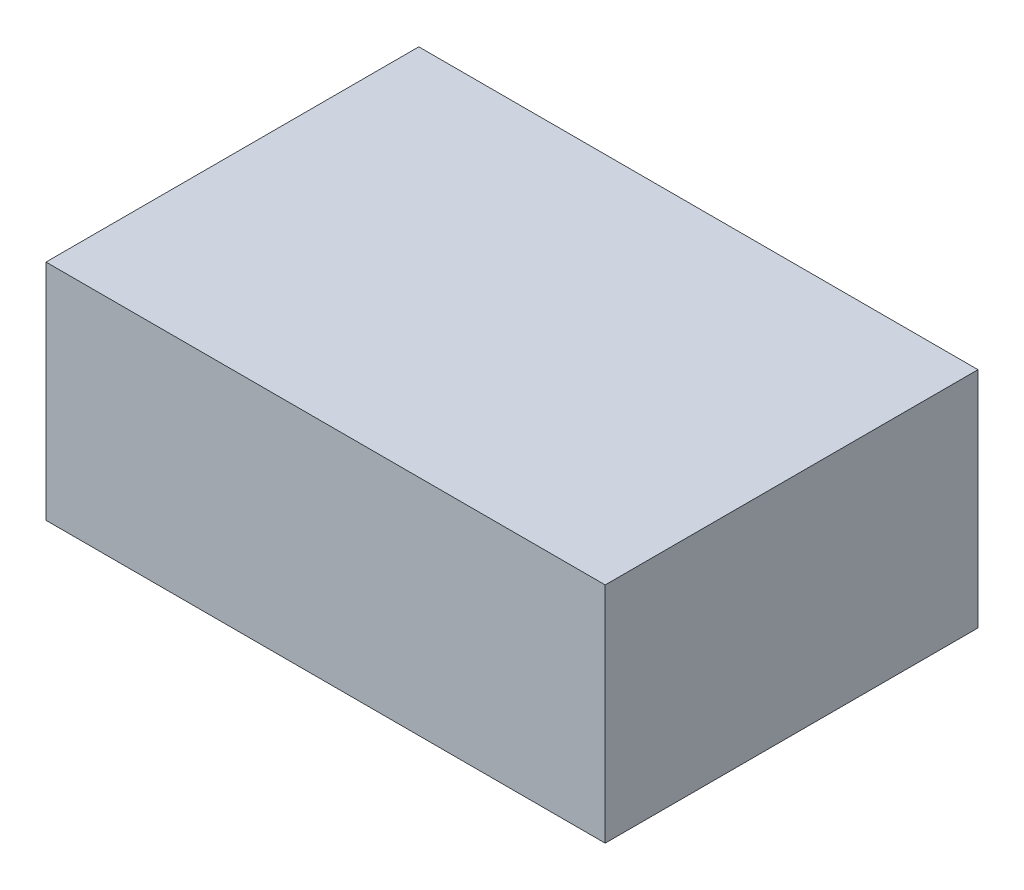
ISO-10303-21;
HEADER;
FILE_DESCRIPTION(('STEP AP214'),'2;1');
FILE_NAME('part.step','',(''),(''),'','','');
FILE_SCHEMA(('AUTOMOTIVE_DESIGN { 1 0 10303 214 1 1 1 1 }'));
ENDSEC;
DATA;
#1=APPLICATION_CONTEXT('core data for automotive mechanical design processes');
#2=APPLICATION_PROTOCOL_DEFINITION('international standard','automotive_design',2000,#1);
#3=PRODUCT_CONTEXT('',#1,'mechanical');
#4=PRODUCT('Part','Part','',(#3));
#5=PRODUCT_RELATED_PRODUCT_CATEGORY('part','',(#4));
#6=PRODUCT_DEFINITION_FORMATION('','',#4);
#7=PRODUCT_DEFINITION_CONTEXT('part definition',#1,'design');
#8=PRODUCT_DEFINITION('design','',#6,#7);
#9=PRODUCT_DEFINITION_SHAPE('','',#8);
#10=(LENGTH_UNIT() NAMED_UNIT(*) SI_UNIT(.MILLI.,.METRE.));
#11=(NAMED_UNIT(*) PLANE_ANGLE_UNIT() SI_UNIT($,.RADIAN.));
#12=(NAMED_UNIT(*) SI_UNIT($,.STERADIAN.) SOLID_ANGLE_UNIT());
#13=UNCERTAINTY_MEASURE_WITH_UNIT(LENGTH_MEASURE(1.E-05),#10,'distance_accuracy_value','');
#14=(GEOMETRIC_REPRESENTATION_CONTEXT(3) GLOBAL_UNCERTAINTY_ASSIGNED_CONTEXT((#13)) GLOBAL_UNIT_ASSIGNED_CONTEXT((#10,
#11,#12)) REPRESENTATION_CONTEXT('',''));
#15=CARTESIAN_POINT('',(0.,0.,0.));
#16=DIRECTION('',(0.,0.,1.));
#17=DIRECTION('',(1.,0.,0.));
#18=AXIS2_PLACEMENT_3D('',#15,#16,#17);
#19=CARTESIAN_POINT('',(150.,120.,-100.));
#20=DIRECTION('',(-1.,0.,0.));
#21=DIRECTION('',(0.,0.,1.));
#22=AXIS2_PLACEMENT_3D('',#19,#20,#21);
#23=PLANE('',#22);
#24=DIRECTION('',(0.,0.,-1.));
#25=VECTOR('',#24,1.);
#26=CARTESIAN_POINT('',(150.,0.,-100.));
#27=LINE('',#26,#25);
#28=CARTESIAN_POINT('',(150.,0.,100.));
#29=VERTEX_POINT('',#28);
#30=CARTESIAN_POINT('',(150.,0.,-100.));
#31=VERTEX_POINT('',#30);
#32=EDGE_CURVE('E95',#29,#31,#27,.T.);
#33=ORIENTED_EDGE('',*,*,#32,.T.);
#34=DIRECTION('',(0.,-1.,0.));
#35=VECTOR('',#34,1.);
#36=CARTESIAN_POINT('',(150.,120.,-100.));
#37=LINE('',#36,#35);
#38=CARTESIAN_POINT('',(150.,120.,-100.));
#39=VERTEX_POINT('',#38);
#40=EDGE_CURVE('E11',#39,#31,#37,.T.);
#41=ORIENTED_EDGE('',*,*,#40,.F.);
#42=DIRECTION('',(0.,0.,-1.));
#43=VECTOR('',#42,1.);
#44=CARTESIAN_POINT('',(150.,120.,-100.));
#45=LINE('',#44,#43);
#46=CARTESIAN_POINT('',(150.,120.,100.));
#47=VERTEX_POINT('',#46);
#48=EDGE_CURVE('E83',#47,#39,#45,.T.);
#49=ORIENTED_EDGE('',*,*,#48,.F.);
#50=DIRECTION('',(0.,-1.,0.));
#51=VECTOR('',#50,1.);
#52=CARTESIAN_POINT('',(150.,120.,100.));
#53=LINE('',#52,#51);
#54=EDGE_CURVE('E91',#47,#29,#53,.T.);
#55=ORIENTED_EDGE('',*,*,#54,.T.);
#56=EDGE_LOOP('',(#33,#41,#49,#55));
#57=FACE_BOUND('',#56,.T.);
#58=ADVANCED_FACE('F32',(#57),#23,.F.);
#59=CARTESIAN_POINT('',(-150.,120.,-100.));
#60=DIRECTION('',(0.,0.,1.));
#61=DIRECTION('',(1.,0.,0.));
#62=AXIS2_PLACEMENT_3D('',#59,#60,#61);
#63=PLANE('',#62);
#64=DIRECTION('',(-1.,0.,0.));
#65=VECTOR('',#64,1.);
#66=CARTESIAN_POINT('',(-150.,0.,-100.));
#67=LINE('',#66,#65);
#68=CARTESIAN_POINT('',(-150.,0.,-100.));
#69=VERTEX_POINT('',#68);
#70=EDGE_CURVE('E87',#31,#69,#67,.T.);
#71=ORIENTED_EDGE('',*,*,#70,.T.);
#72=DIRECTION('',(0.,-1.,0.));
#73=VECTOR('',#72,1.);
#74=CARTESIAN_POINT('',(-150.,120.,-100.));
#75=LINE('',#74,#73);
#76=CARTESIAN_POINT('',(-150.,120.,-100.));
#77=VERTEX_POINT('',#76);
#78=EDGE_CURVE('E40',#77,#69,#75,.T.);
#79=ORIENTED_EDGE('',*,*,#78,.F.);
#80=DIRECTION('',(-1.,0.,0.));
#81=VECTOR('',#80,1.);
#82=CARTESIAN_POINT('',(-150.,120.,-100.));
#83=LINE('',#82,#81);
#84=EDGE_CURVE('E78',#39,#77,#83,.T.);
#85=ORIENTED_EDGE('',*,*,#84,.F.);
#86=ORIENTED_EDGE('',*,*,#40,.T.);
#87=EDGE_LOOP('',(#71,#79,#85,#86));
#88=FACE_BOUND('',#87,.T.);
#89=ADVANCED_FACE('F86',(#88),#63,.F.);
#90=CARTESIAN_POINT('',(-150.,120.,-100.));
#91=DIRECTION('',(1.,0.,0.));
#92=DIRECTION('',(0.,0.,-1.));
#93=AXIS2_PLACEMENT_3D('',#90,#91,#92);
#94=PLANE('',#93);
#95=DIRECTION('',(0.,0.,1.));
#96=VECTOR('',#95,1.);
#97=CARTESIAN_POINT('',(-150.,0.,-100.));
#98=LINE('',#97,#96);
#99=CARTESIAN_POINT('',(-150.,0.,100.));
#100=VERTEX_POINT('',#99);
#101=EDGE_CURVE('E65',#69,#100,#98,.T.);
#102=ORIENTED_EDGE('',*,*,#101,.T.);
#103=DIRECTION('',(0.,-1.,0.));
#104=VECTOR('',#103,1.);
#105=CARTESIAN_POINT('',(-150.,120.,100.));
#106=LINE('',#105,#104);
#107=CARTESIAN_POINT('',(-150.,120.,100.));
#108=VERTEX_POINT('',#107);
#109=EDGE_CURVE('E88',#108,#100,#106,.T.);
#110=ORIENTED_EDGE('',*,*,#109,.F.);
#111=DIRECTION('',(0.,0.,1.));
#112=VECTOR('',#111,1.);
#113=CARTESIAN_POINT('',(-150.,120.,-100.));
#114=LINE('',#113,#112);
#115=EDGE_CURVE('E81',#77,#108,#114,.T.);
#116=ORIENTED_EDGE('',*,*,#115,.F.);
#117=ORIENTED_EDGE('',*,*,#78,.T.);
#118=EDGE_LOOP('',(#102,#110,#116,#117));
#119=FACE_BOUND('',#118,.T.);
#120=ADVANCED_FACE('F89',(#119),#94,.F.);
#121=CARTESIAN_POINT('',(-150.,120.,100.));
#122=DIRECTION('',(0.,0.,-1.));
#123=DIRECTION('',(-1.,0.,0.));
#124=AXIS2_PLACEMENT_3D('',#121,#122,#123);
#125=PLANE('',#124);
#126=DIRECTION('',(1.,0.,0.));
#127=VECTOR('',#126,1.);
#128=CARTESIAN_POINT('',(-150.,0.,100.));
#129=LINE('',#128,#127);
#130=EDGE_CURVE('E71',#100,#29,#129,.T.);
#131=ORIENTED_EDGE('',*,*,#130,.T.);
#132=ORIENTED_EDGE('',*,*,#54,.F.);
#133=DIRECTION('',(1.,0.,0.));
#134=VECTOR('',#133,1.);
#135=CARTESIAN_POINT('',(-150.,120.,100.));
#136=LINE('',#135,#134);
#137=EDGE_CURVE('E48',#108,#47,#136,.T.);
#138=ORIENTED_EDGE('',*,*,#137,.F.);
#139=ORIENTED_EDGE('',*,*,#109,.T.);
#140=EDGE_LOOP('',(#131,#132,#138,#139));
#141=FACE_BOUND('',#140,.T.);
#142=ADVANCED_FACE('F102',(#141),#125,.F.);
#143=CARTESIAN_POINT('',(0.,120.,0.));
#144=DIRECTION('',(0.,1.,0.));
#145=DIRECTION('',(0.,0.,1.));
#146=AXIS2_PLACEMENT_3D('',#143,#144,#145);
#147=PLANE('',#146);
#148=ORIENTED_EDGE('',*,*,#48,.T.);
#149=ORIENTED_EDGE('',*,*,#84,.T.);
#150=ORIENTED_EDGE('',*,*,#115,.T.);
#151=ORIENTED_EDGE('',*,*,#137,.T.);
#152=EDGE_LOOP('',(#148,#149,#150,#151));
#153=FACE_BOUND('',#152,.T.);
#154=ADVANCED_FACE('F79',(#153),#147,.T.);
#155=CARTESIAN_POINT('',(0.,0.,0.));
#156=DIRECTION('',(0.,1.,0.));
#157=DIRECTION('',(0.,0.,1.));
#158=AXIS2_PLACEMENT_3D('',#155,#156,#157);
#159=PLANE('',#158);
#160=ORIENTED_EDGE('',*,*,#32,.F.);
#161=ORIENTED_EDGE('',*,*,#130,.F.);
#162=ORIENTED_EDGE('',*,*,#101,.F.);
#163=ORIENTED_EDGE('',*,*,#70,.F.);
#164=EDGE_LOOP('',(#160,#161,#162,#163));
#165=FACE_BOUND('',#164,.T.);
#166=ADVANCED_FACE('F105',(#165),#159,.F.);
#167=CLOSED_SHELL('',(#58,#89,#120,#142,#154,#166));
#168=MANIFOLD_SOLID_BREP('B2',#167);
#169=ADVANCED_BREP_SHAPE_REPRESENTATION('',(#18,#168),#14);
#170=SHAPE_DEFINITION_REPRESENTATION(#9,#169);
ENDSEC;
END-ISO-10303-21;
